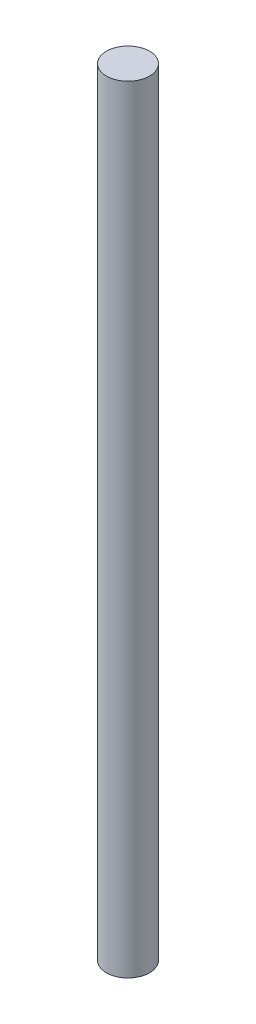
ISO-10303-21;
HEADER;
FILE_DESCRIPTION(('STEP AP214'),'2;1');
FILE_NAME('part.step','',(''),(''),'','','');
FILE_SCHEMA(('AUTOMOTIVE_DESIGN { 1 0 10303 214 1 1 1 1 }'));
ENDSEC;
DATA;
#1=APPLICATION_CONTEXT('core data for automotive mechanical design processes');
#2=APPLICATION_PROTOCOL_DEFINITION('international standard','automotive_design',2000,#1);
#3=PRODUCT_CONTEXT('',#1,'mechanical');
#4=PRODUCT('Part','Part','',(#3));
#5=PRODUCT_RELATED_PRODUCT_CATEGORY('part','',(#4));
#6=PRODUCT_DEFINITION_FORMATION('','',#4);
#7=PRODUCT_DEFINITION_CONTEXT('part definition',#1,'design');
#8=PRODUCT_DEFINITION('design','',#6,#7);
#9=PRODUCT_DEFINITION_SHAPE('','',#8);
#10=(LENGTH_UNIT() NAMED_UNIT(*) SI_UNIT(.MILLI.,.METRE.));
#11=(NAMED_UNIT(*) PLANE_ANGLE_UNIT() SI_UNIT($,.RADIAN.));
#12=(NAMED_UNIT(*) SI_UNIT($,.STERADIAN.) SOLID_ANGLE_UNIT());
#13=UNCERTAINTY_MEASURE_WITH_UNIT(LENGTH_MEASURE(1.E-05),#10,'distance_accuracy_value','');
#14=(GEOMETRIC_REPRESENTATION_CONTEXT(3) GLOBAL_UNCERTAINTY_ASSIGNED_CONTEXT((#13)) GLOBAL_UNIT_ASSIGNED_CONTEXT((#10,
#11,#12)) REPRESENTATION_CONTEXT('',''));
#15=CARTESIAN_POINT('',(0.,0.,0.));
#16=DIRECTION('',(0.,0.,1.));
#17=DIRECTION('',(1.,0.,0.));
#18=AXIS2_PLACEMENT_3D('',#15,#16,#17);
#19=CARTESIAN_POINT('',(0.,114.3,0.));
#20=DIRECTION('',(0.,-1.,0.));
#21=DIRECTION('',(0.,0.,-1.));
#22=AXIS2_PLACEMENT_3D('',#19,#20,#21);
#23=CYLINDRICAL_SURFACE('',#22,3.175);
#24=CARTESIAN_POINT('',(0.,114.3,0.));
#25=DIRECTION('',(0.,1.,0.));
#26=DIRECTION('',(0.,0.,1.));
#27=AXIS2_PLACEMENT_3D('',#24,#25,#26);
#28=CIRCLE('',#27,3.175);
#29=CARTESIAN_POINT('',(0.,114.3,3.175));
#30=VERTEX_POINT('',#29);
#31=EDGE_CURVE('E10',#30,#30,#28,.T.);
#32=ORIENTED_EDGE('',*,*,#31,.F.);
#33=EDGE_LOOP('',(#32));
#34=FACE_BOUND('',#33,.T.);
#35=CARTESIAN_POINT('',(0.,0.,0.));
#36=DIRECTION('',(0.,1.,0.));
#37=DIRECTION('',(0.,0.,1.));
#38=AXIS2_PLACEMENT_3D('',#35,#36,#37);
#39=CIRCLE('',#38,3.175);
#40=CARTESIAN_POINT('',(0.,0.,3.175));
#41=VERTEX_POINT('',#40);
#42=EDGE_CURVE('E40',#41,#41,#39,.T.);
#43=ORIENTED_EDGE('',*,*,#42,.T.);
#44=EDGE_LOOP('',(#43));
#45=FACE_BOUND('',#44,.T.);
#46=ADVANCED_FACE('F37',(#34,#45),#23,.T.);
#47=CARTESIAN_POINT('',(0.,114.3,0.));
#48=DIRECTION('',(0.,1.,0.));
#49=DIRECTION('',(0.,0.,1.));
#50=AXIS2_PLACEMENT_3D('',#47,#48,#49);
#51=PLANE('',#50);
#52=ORIENTED_EDGE('',*,*,#31,.T.);
#53=EDGE_LOOP('',(#52));
#54=FACE_BOUND('',#53,.T.);
#55=ADVANCED_FACE('F54',(#54),#51,.T.);
#56=CARTESIAN_POINT('',(0.,0.,0.));
#57=DIRECTION('',(0.,1.,0.));
#58=DIRECTION('',(0.,0.,1.));
#59=AXIS2_PLACEMENT_3D('',#56,#57,#58);
#60=PLANE('',#59);
#61=ORIENTED_EDGE('',*,*,#42,.F.);
#62=EDGE_LOOP('',(#61));
#63=FACE_BOUND('',#62,.T.);
#64=ADVANCED_FACE('F52',(#63),#60,.F.);
#65=CLOSED_SHELL('',(#46,#55,#64));
#66=MANIFOLD_SOLID_BREP('B2',#65);
#67=ADVANCED_BREP_SHAPE_REPRESENTATION('',(#18,#66),#14);
#68=SHAPE_DEFINITION_REPRESENTATION(#9,#67);
ENDSEC;
END-ISO-10303-21;
